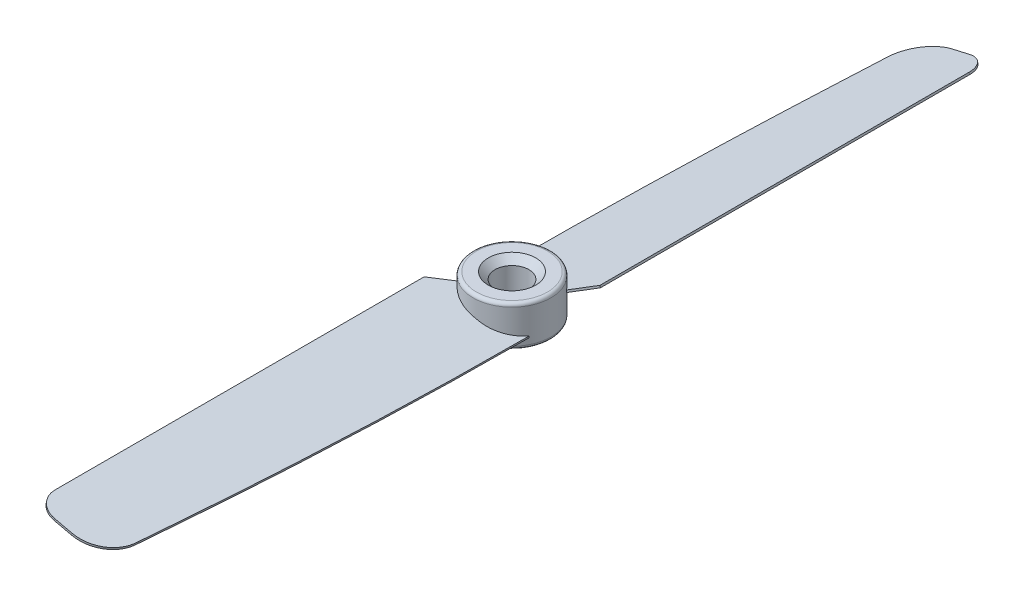
ISO-10303-21;
HEADER;
FILE_DESCRIPTION(('STEP AP214'),'2;1');
FILE_NAME('part.step','',(''),(''),'','','');
FILE_SCHEMA(('AUTOMOTIVE_DESIGN { 1 0 10303 214 1 1 1 1 }'));
ENDSEC;
DATA;
#1=APPLICATION_CONTEXT('core data for automotive mechanical design processes');
#2=APPLICATION_PROTOCOL_DEFINITION('international standard','automotive_design',2000,#1);
#3=PRODUCT_CONTEXT('',#1,'mechanical');
#4=PRODUCT('Part','Part','',(#3));
#5=PRODUCT_RELATED_PRODUCT_CATEGORY('part','',(#4));
#6=PRODUCT_DEFINITION_FORMATION('','',#4);
#7=PRODUCT_DEFINITION_CONTEXT('part definition',#1,'design');
#8=PRODUCT_DEFINITION('design','',#6,#7);
#9=PRODUCT_DEFINITION_SHAPE('','',#8);
#10=(LENGTH_UNIT() NAMED_UNIT(*) SI_UNIT(.MILLI.,.METRE.));
#11=(NAMED_UNIT(*) PLANE_ANGLE_UNIT() SI_UNIT($,.RADIAN.));
#12=(NAMED_UNIT(*) SI_UNIT($,.STERADIAN.) SOLID_ANGLE_UNIT());
#13=UNCERTAINTY_MEASURE_WITH_UNIT(LENGTH_MEASURE(1.E-05),#10,'distance_accuracy_value','');
#14=(GEOMETRIC_REPRESENTATION_CONTEXT(3) GLOBAL_UNCERTAINTY_ASSIGNED_CONTEXT((#13)) GLOBAL_UNIT_ASSIGNED_CONTEXT((#10,
#11,#12)) REPRESENTATION_CONTEXT('',''));
#15=CARTESIAN_POINT('',(0.,0.,0.));
#16=DIRECTION('',(0.,0.,1.));
#17=DIRECTION('',(1.,0.,0.));
#18=AXIS2_PLACEMENT_3D('',#15,#16,#17);
#19=CARTESIAN_POINT('',(0.,3.,0.));
#20=DIRECTION('',(0.,-1.,0.));
#21=DIRECTION('',(0.,0.,-1.));
#22=AXIS2_PLACEMENT_3D('',#19,#20,#21);
#23=CYLINDRICAL_SURFACE('',#22,5.75);
#24=CARTESIAN_POINT('',(0.,2.5,0.));
#25=DIRECTION('',(0.,1.,0.));
#26=DIRECTION('',(0.,0.,1.));
#27=AXIS2_PLACEMENT_3D('',#24,#25,#26);
#28=CIRCLE('',#27,5.75);
#29=CARTESIAN_POINT('',(0.,2.5,5.75));
#30=VERTEX_POINT('',#29);
#31=EDGE_CURVE('E665',#30,#30,#28,.F.);
#32=ORIENTED_EDGE('',*,*,#31,.T.);
#33=EDGE_LOOP('',(#32));
#34=FACE_BOUND('',#33,.T.);
#35=CARTESIAN_POINT('',(0.,-2.5,0.));
#36=DIRECTION('',(0.,1.,0.));
#37=DIRECTION('',(0.,0.,1.));
#38=AXIS2_PLACEMENT_3D('',#35,#36,#37);
#39=CIRCLE('',#38,5.75);
#40=CARTESIAN_POINT('',(0.,-2.5,5.75));
#41=VERTEX_POINT('',#40);
#42=EDGE_CURVE('E676',#41,#41,#39,.T.);
#43=ORIENTED_EDGE('',*,*,#42,.T.);
#44=EDGE_LOOP('',(#43));
#45=FACE_BOUND('',#44,.T.);
#46=CARTESIAN_POINT('',(-0.3546221575821,0.0720746401149887,-5.73905420129053));
#47=CARTESIAN_POINT('',(-0.348852411201838,0.0220916056183077,-5.73941071685677));
#48=CARTESIAN_POINT('',(-0.343082658076187,-0.0278914873125292,-5.7397585033949));
#49=CARTESIAN_POINT('',(-0.331543138334108,-0.127857790042515,-5.74043661841496));
#50=CARTESIAN_POINT('',(-0.325773371717681,-0.177840999841664,-5.74076694689689));
#51=CARTESIAN_POINT('',(-0.320003598355864,-0.227824268074969,-5.74108854635071));
#52=B_SPLINE_CURVE_WITH_KNOTS('',3,(#46,#47,#48,#49,#50,#51),.UNSPECIFIED.,.F.,.F.,(4,2,4),(0.,
0.15094861797929,0.301897235958581),.UNSPECIFIED.);
#53=CARTESIAN_POINT('',(-0.354622157582998,0.0720746401147804,-5.73905420129059));
#54=VERTEX_POINT('',#53);
#55=CARTESIAN_POINT('',(-0.320003598354752,-0.227824268074841,-5.74108854635065));
#56=VERTEX_POINT('',#55);
#57=EDGE_CURVE('E63',#54,#56,#52,.T.);
#58=ORIENTED_EDGE('',*,*,#57,.T.);
#59=CARTESIAN_POINT('',(0.,-0.153945616169008,0.));
#60=DIRECTION('',(0.224951054343865,-0.974370064785235,0.));
#61=DIRECTION('',(-0.974370064785235,-0.224951054343865,0.));
#62=AXIS2_PLACEMENT_3D('',#59,#60,#61);
#63=ELLIPSE('',#62,5.901248619812,5.75);
#64=CARTESIAN_POINT('',(4.62916827045642,0.914782088847119,-3.41076254286333));
#65=VERTEX_POINT('',#64);
#66=EDGE_CURVE('E67',#56,#65,#63,.T.);
#67=ORIENTED_EDGE('',*,*,#66,.T.);
#68=CARTESIAN_POINT('',(0.,5.80366979791248,0.));
#69=DIRECTION('',(0.688983680194812,0.15906441596161,0.707106781186551));
#70=DIRECTION('',(0.111006093354591,-0.987268206504591,0.113926009599915));
#71=AXIS2_PLACEMENT_3D('',#68,#69,#70);
#72=ELLIPSE('',#71,36.1488769517612,5.75);
#73=CARTESIAN_POINT('',(4.59996292440263,1.2159307357705,-3.45004943357646));
#74=VERTEX_POINT('',#73);
#75=EDGE_CURVE('E207',#65,#74,#72,.T.);
#76=ORIENTED_EDGE('',*,*,#75,.T.);
#77=CARTESIAN_POINT('',(0.,0.153945616169009,0.));
#78=DIRECTION('',(0.224951054343865,-0.974370064785235,0.));
#79=DIRECTION('',(-0.974370064785235,-0.224951054343865,0.));
#80=AXIS2_PLACEMENT_3D('',#77,#78,#79);
#81=ELLIPSE('',#80,5.901248619812,5.75);
#82=EDGE_CURVE('E649',#54,#74,#81,.T.);
#83=ORIENTED_EDGE('',*,*,#82,.F.);
#84=EDGE_LOOP('',(#58,#67,#76,#83));
#85=FACE_BOUND('',#84,.T.);
#86=CARTESIAN_POINT('',(0.3546221575821,0.0720746401149888,5.73905420129053));
#87=CARTESIAN_POINT('',(0.348852411201838,0.0220916056183078,5.73941071685677));
#88=CARTESIAN_POINT('',(0.343082658076187,-0.0278914873125292,5.7397585033949));
#89=CARTESIAN_POINT('',(0.331543138334108,-0.127857790042515,5.74043661841496));
#90=CARTESIAN_POINT('',(0.325773371717681,-0.177840999841664,5.74076694689689));
#91=CARTESIAN_POINT('',(0.320003598355864,-0.227824268074969,5.74108854635071));
#92=B_SPLINE_CURVE_WITH_KNOTS('',3,(#86,#87,#88,#89,#90,#91),.UNSPECIFIED.,.F.,.F.,(4,2,4),(0.,
0.15094861797929,0.301897235958581),.UNSPECIFIED.);
#93=CARTESIAN_POINT('',(0.354622157582998,0.0720746401147804,5.73905420129059));
#94=VERTEX_POINT('',#93);
#95=CARTESIAN_POINT('',(0.320003598354752,-0.227824268074841,5.74108854635065));
#96=VERTEX_POINT('',#95);
#97=EDGE_CURVE('E222',#94,#96,#92,.T.);
#98=ORIENTED_EDGE('',*,*,#97,.T.);
#99=CARTESIAN_POINT('',(0.,-0.153945616169008,0.));
#100=DIRECTION('',(-0.224951054343865,-0.974370064785235,0.));
#101=DIRECTION('',(0.974370064785235,-0.224951054343865,0.));
#102=AXIS2_PLACEMENT_3D('',#99,#100,#101);
#103=ELLIPSE('',#102,5.901248619812,5.75);
#104=CARTESIAN_POINT('',(-4.62916827045642,0.914782088847119,3.41076254286333));
#105=VERTEX_POINT('',#104);
#106=EDGE_CURVE('E230',#96,#105,#103,.T.);
#107=ORIENTED_EDGE('',*,*,#106,.T.);
#108=CARTESIAN_POINT('',(0.,5.80366979791248,0.));
#109=DIRECTION('',(-0.688983680194812,0.15906441596161,-0.707106781186551));
#110=DIRECTION('',(-0.111006093354591,-0.987268206504591,-0.113926009599915));
#111=AXIS2_PLACEMENT_3D('',#108,#109,#110);
#112=ELLIPSE('',#111,36.1488769517612,5.75);
#113=CARTESIAN_POINT('',(-4.59996292440263,1.2159307357705,3.45004943357646));
#114=VERTEX_POINT('',#113);
#115=EDGE_CURVE('E231',#105,#114,#112,.T.);
#116=ORIENTED_EDGE('',*,*,#115,.T.);
#117=CARTESIAN_POINT('',(0.,0.153945616169009,0.));
#118=DIRECTION('',(-0.224951054343865,-0.974370064785235,0.));
#119=DIRECTION('',(0.974370064785235,-0.224951054343865,0.));
#120=AXIS2_PLACEMENT_3D('',#117,#118,#119);
#121=ELLIPSE('',#120,5.901248619812,5.75);
#122=EDGE_CURVE('E303',#94,#114,#121,.T.);
#123=ORIENTED_EDGE('',*,*,#122,.F.);
#124=EDGE_LOOP('',(#98,#107,#116,#123));
#125=FACE_BOUND('',#124,.T.);
#126=ADVANCED_FACE('F47',(#34,#45,#85,#125),#23,.T.);
#127=CARTESIAN_POINT('',(0.,3.,0.));
#128=DIRECTION('',(0.,1.,0.));
#129=DIRECTION('',(0.,0.,1.));
#130=AXIS2_PLACEMENT_3D('',#127,#128,#129);
#131=PLANE('',#130);
#132=CARTESIAN_POINT('',(0.,3.,0.));
#133=DIRECTION('',(0.,1.,0.));
#134=DIRECTION('',(0.,0.,1.));
#135=AXIS2_PLACEMENT_3D('',#132,#133,#134);
#136=CIRCLE('',#135,3.5);
#137=CARTESIAN_POINT('',(0.,3.,3.5));
#138=VERTEX_POINT('',#137);
#139=EDGE_CURVE('E11',#138,#138,#136,.F.);
#140=ORIENTED_EDGE('',*,*,#139,.T.);
#141=EDGE_LOOP('',(#140));
#142=FACE_BOUND('',#141,.T.);
#143=CARTESIAN_POINT('',(0.,3.,0.));
#144=DIRECTION('',(0.,1.,0.));
#145=DIRECTION('',(0.,0.,1.));
#146=AXIS2_PLACEMENT_3D('',#143,#144,#145);
#147=CIRCLE('',#146,5.25);
#148=CARTESIAN_POINT('',(0.,3.,5.25));
#149=VERTEX_POINT('',#148);
#150=EDGE_CURVE('E678',#149,#149,#147,.T.);
#151=ORIENTED_EDGE('',*,*,#150,.T.);
#152=EDGE_LOOP('',(#151));
#153=FACE_BOUND('',#152,.T.);
#154=ADVANCED_FACE('F214',(#142,#153),#131,.T.);
#155=CARTESIAN_POINT('',(0.,-3.,0.));
#156=DIRECTION('',(0.,1.,0.));
#157=DIRECTION('',(0.,0.,1.));
#158=AXIS2_PLACEMENT_3D('',#155,#156,#157);
#159=PLANE('',#158);
#160=CARTESIAN_POINT('',(0.,-3.,0.));
#161=DIRECTION('',(0.,1.,0.));
#162=DIRECTION('',(0.,0.,1.));
#163=AXIS2_PLACEMENT_3D('',#160,#161,#162);
#164=CIRCLE('',#163,3.50000000000003);
#165=CARTESIAN_POINT('',(0.,-3.,3.50000000000003));
#166=VERTEX_POINT('',#165);
#167=EDGE_CURVE('E56',#166,#166,#164,.T.);
#168=ORIENTED_EDGE('',*,*,#167,.T.);
#169=EDGE_LOOP('',(#168));
#170=FACE_BOUND('',#169,.T.);
#171=CARTESIAN_POINT('',(0.,-3.,0.));
#172=DIRECTION('',(0.,1.,0.));
#173=DIRECTION('',(0.,0.,1.));
#174=AXIS2_PLACEMENT_3D('',#171,#172,#173);
#175=CIRCLE('',#174,5.25);
#176=CARTESIAN_POINT('',(0.,-3.,5.25));
#177=VERTEX_POINT('',#176);
#178=EDGE_CURVE('E661',#177,#177,#175,.F.);
#179=ORIENTED_EDGE('',*,*,#178,.T.);
#180=EDGE_LOOP('',(#179));
#181=FACE_BOUND('',#180,.T.);
#182=ADVANCED_FACE('F216',(#170,#181),#159,.F.);
#183=CARTESIAN_POINT('',(0.623814062032037,-0.297964440269032,0.));
#184=DIRECTION('',(-0.224951054343865,-0.974370064785235,0.));
#185=DIRECTION('',(0.,0.,1.));
#186=AXIS2_PLACEMENT_3D('',#183,#184,#185);
#187=ELLIPSE('',#186,5.75,5.6026278725151);
#188=DIRECTION('',(0.224951054343865,0.974370064785235,0.));
#189=VECTOR('',#188,1.);
#190=SURFACE_OF_LINEAR_EXTRUSION('',#187,#189);
#191=ORIENTED_EDGE('',*,*,#97,.F.);
#192=CARTESIAN_POINT('',(0.691299378335197,-0.00565342083346169,0.));
#193=DIRECTION('',(-0.224951054343865,-0.974370064785235,0.));
#194=DIRECTION('',(0.,0.,1.));
#195=AXIS2_PLACEMENT_3D('',#192,#193,#194);
#196=ELLIPSE('',#195,5.75,5.6026278725151);
#197=CARTESIAN_POINT('',(5.42014469558702,-1.09739338533998,2.8728385710794));
#198=VERTEX_POINT('',#197);
#199=EDGE_CURVE('E168',#198,#94,#196,.T.);
#200=ORIENTED_EDGE('',*,*,#199,.F.);
#201=DIRECTION('',(0.224951054343865,0.974370064785235,0.));
#202=VECTOR('',#201,1.);
#203=CARTESIAN_POINT('',(5.35265937928386,-1.38970440477555,2.8728385710794));
#204=LINE('',#203,#202);
#205=CARTESIAN_POINT('',(5.35265937928386,-1.38970440477555,2.8728385710794));
#206=VERTEX_POINT('',#205);
#207=EDGE_CURVE('E302',#206,#198,#204,.T.);
#208=ORIENTED_EDGE('',*,*,#207,.F.);
#209=EDGE_CURVE('E242',#206,#96,#187,.T.);
#210=ORIENTED_EDGE('',*,*,#209,.T.);
#211=EDGE_LOOP('',(#191,#200,#208,#210));
#212=FACE_BOUND('',#211,.T.);
#213=ADVANCED_FACE('F233',(#212),#190,.T.);
#214=CARTESIAN_POINT('',(5.35265937928386,-1.38970440477555,2.8728385710794));
#215=CARTESIAN_POINT('',(5.32497568570436,-1.38331312051518,33.8349371955117));
#216=CARTESIAN_POINT('',(3.28593611679365,-0.912563743607314,56.9677536577905));
#217=CARTESIAN_POINT('',(3.27588606991554,-0.910243507463838,58.532948550035));
#218=B_SPLINE_CURVE_WITH_KNOTS('',3,(#214,#215,#216,#217),.UNSPECIFIED.,.F.,.F.,(4,4),(0.,
0.918193757625194),.UNSPECIFIED.);
#219=DIRECTION('',(0.224951054343865,0.974370064785235,0.));
#220=VECTOR('',#219,1.);
#221=SURFACE_OF_LINEAR_EXTRUSION('',#218,#220);
#222=CARTESIAN_POINT('',(5.42014469558702,-1.09739338533998,2.8728385710794));
#223=CARTESIAN_POINT('',(5.39246100200752,-1.09100210107961,33.8349371955117));
#224=CARTESIAN_POINT('',(3.35342143309681,-0.620252724171744,56.9677536577905));
#225=CARTESIAN_POINT('',(3.3433713862187,-0.617932488028267,58.532948550035));
#226=B_SPLINE_CURVE_WITH_KNOTS('',3,(#222,#223,#224,#225),.UNSPECIFIED.,.F.,.F.,(4,4),(0.,
0.918193757625194),.UNSPECIFIED.);
#227=CARTESIAN_POINT('',(3.34337138621871,-0.617932488028264,58.5329485500349));
#228=VERTEX_POINT('',#227);
#229=EDGE_CURVE('E271',#198,#228,#226,.T.);
#230=ORIENTED_EDGE('',*,*,#229,.T.);
#231=DIRECTION('',(0.224951054343865,0.974370064785235,0.));
#232=VECTOR('',#231,1.);
#233=CARTESIAN_POINT('',(3.27588606991555,-0.910243507463834,58.5329485500349));
#234=LINE('',#233,#232);
#235=CARTESIAN_POINT('',(3.27588606991555,-0.910243507463834,58.5329485500349));
#236=VERTEX_POINT('',#235);
#237=EDGE_CURVE('E299',#236,#228,#234,.T.);
#238=ORIENTED_EDGE('',*,*,#237,.F.);
#239=EDGE_CURVE('E245',#206,#236,#218,.T.);
#240=ORIENTED_EDGE('',*,*,#239,.F.);
#241=ORIENTED_EDGE('',*,*,#207,.T.);
#242=EDGE_LOOP('',(#230,#238,#240,#241));
#243=FACE_BOUND('',#242,.T.);
#244=ADVANCED_FACE('F238',(#243),#221,.F.);
#245=CARTESIAN_POINT('',(-1.59585847457091,0.214487343147585,58.5));
#246=DIRECTION('',(0.224951054343865,0.974370064785235,0.));
#247=DIRECTION('',(-0.974370064785235,0.224951054343865,0.));
#248=AXIS2_PLACEMENT_3D('',#245,#246,#247);
#249=CYLINDRICAL_SURFACE('',#248,5.);
#250=CARTESIAN_POINT('',(-1.52837315826775,0.506798362583155,58.5));
#251=DIRECTION('',(-0.224951054343865,-0.974370064785235,0.));
#252=DIRECTION('',(0.974370064785235,-0.224951054343865,0.));
#253=AXIS2_PLACEMENT_3D('',#250,#251,#252);
#254=CIRCLE('',#253,5.);
#255=CARTESIAN_POINT('',(-1.52837315826775,0.50679836258315,63.5));
#256=VERTEX_POINT('',#255);
#257=EDGE_CURVE('E275',#228,#256,#254,.T.);
#258=ORIENTED_EDGE('',*,*,#257,.T.);
#259=DIRECTION('',(0.224951054343865,0.974370064785235,0.));
#260=VECTOR('',#259,1.);
#261=CARTESIAN_POINT('',(-1.59585847457091,0.21448734314758,63.5));
#262=LINE('',#261,#260);
#263=CARTESIAN_POINT('',(-1.59585847457091,0.21448734314758,63.5));
#264=VERTEX_POINT('',#263);
#265=EDGE_CURVE('E297',#264,#256,#262,.T.);
#266=ORIENTED_EDGE('',*,*,#265,.F.);
#267=CARTESIAN_POINT('',(-1.59585847457091,0.214487343147585,58.5));
#268=DIRECTION('',(-0.224951054343865,-0.974370064785235,0.));
#269=DIRECTION('',(0.974370064785235,-0.224951054343865,0.));
#270=AXIS2_PLACEMENT_3D('',#267,#268,#269);
#271=CIRCLE('',#270,5.);
#272=EDGE_CURVE('E252',#236,#264,#271,.T.);
#273=ORIENTED_EDGE('',*,*,#272,.F.);
#274=ORIENTED_EDGE('',*,*,#237,.T.);
#275=EDGE_LOOP('',(#258,#266,#273,#274));
#276=FACE_BOUND('',#275,.T.);
#277=ADVANCED_FACE('F333',(#276),#249,.T.);
#278=CARTESIAN_POINT('',(-0.033742658151579,-0.146155509717782,63.5));
#279=DIRECTION('',(0.,0.,1.));
#280=DIRECTION('',(1.,0.,0.));
#281=AXIS2_PLACEMENT_3D('',#278,#279,#280);
#282=PLANE('',#281);
#283=DIRECTION('',(0.974370064785235,-0.224951054343865,0.));
#284=VECTOR('',#283,1.);
#285=CARTESIAN_POINT('',(0.0337426581515806,0.146155509717789,63.5));
#286=LINE('',#285,#284);
#287=CARTESIAN_POINT('',(-4.11710145840395,1.10445338255115,63.5));
#288=VERTEX_POINT('',#287);
#289=EDGE_CURVE('E281',#288,#256,#286,.T.);
#290=ORIENTED_EDGE('',*,*,#289,.F.);
#291=DIRECTION('',(0.224951054343865,0.974370064785235,0.));
#292=VECTOR('',#291,1.);
#293=CARTESIAN_POINT('',(-4.18458677470711,0.812142363115578,63.5));
#294=LINE('',#293,#292);
#295=CARTESIAN_POINT('',(-4.18458677470711,0.812142363115578,63.5));
#296=VERTEX_POINT('',#295);
#297=EDGE_CURVE('E295',#296,#288,#294,.T.);
#298=ORIENTED_EDGE('',*,*,#297,.F.);
#299=DIRECTION('',(0.974370064785235,-0.224951054343865,0.));
#300=VECTOR('',#299,1.);
#301=CARTESIAN_POINT('',(-0.033742658151579,-0.146155509717782,63.5));
#302=LINE('',#301,#300);
#303=EDGE_CURVE('E257',#296,#264,#302,.T.);
#304=ORIENTED_EDGE('',*,*,#303,.T.);
#305=ORIENTED_EDGE('',*,*,#265,.T.);
#306=EDGE_LOOP('',(#290,#298,#304,#305));
#307=FACE_BOUND('',#306,.T.);
#308=ADVANCED_FACE('F329',(#307),#282,.T.);
#309=CARTESIAN_POINT('',(-4.18458677470712,0.812142363115587,60.5));
#310=DIRECTION('',(0.224951054343865,0.974370064785235,0.));
#311=DIRECTION('',(-0.974370064785235,0.224951054343865,0.));
#312=AXIS2_PLACEMENT_3D('',#309,#310,#311);
#313=CYLINDRICAL_SURFACE('',#312,3.);
#314=CARTESIAN_POINT('',(-4.11710145840396,1.10445338255116,60.5));
#315=DIRECTION('',(-0.224951054343865,-0.974370064785235,0.));
#316=DIRECTION('',(0.974370064785235,-0.224951054343865,0.));
#317=AXIS2_PLACEMENT_3D('',#314,#315,#316);
#318=CIRCLE('',#317,3.);
#319=CARTESIAN_POINT('',(-7.04021165275967,1.77930654558275,60.5));
#320=VERTEX_POINT('',#319);
#321=EDGE_CURVE('E284',#320,#288,#318,.F.);
#322=ORIENTED_EDGE('',*,*,#321,.F.);
#323=DIRECTION('',(0.224951054343865,0.974370064785235,0.));
#324=VECTOR('',#323,1.);
#325=CARTESIAN_POINT('',(-7.10769696906283,1.48699552614718,60.5));
#326=LINE('',#325,#324);
#327=CARTESIAN_POINT('',(-7.10769696906283,1.48699552614718,60.5));
#328=VERTEX_POINT('',#327);
#329=EDGE_CURVE('E293',#328,#320,#326,.T.);
#330=ORIENTED_EDGE('',*,*,#329,.F.);
#331=CARTESIAN_POINT('',(-4.18458677470712,0.812142363115587,60.5));
#332=DIRECTION('',(-0.224951054343865,-0.974370064785235,0.));
#333=DIRECTION('',(0.974370064785235,-0.224951054343865,0.));
#334=AXIS2_PLACEMENT_3D('',#331,#332,#333);
#335=CIRCLE('',#334,3.);
#336=EDGE_CURVE('E260',#328,#296,#335,.F.);
#337=ORIENTED_EDGE('',*,*,#336,.T.);
#338=ORIENTED_EDGE('',*,*,#297,.T.);
#339=EDGE_LOOP('',(#322,#330,#337,#338));
#340=FACE_BOUND('',#339,.T.);
#341=ADVANCED_FACE('F327',(#340),#313,.T.);
#342=CARTESIAN_POINT('',(-7.10769696906284,1.48699552614718,0.));
#343=DIRECTION('',(-0.974370064785235,0.224951054343865,0.));
#344=DIRECTION('',(-0.224951054343865,-0.974370064785235,0.));
#345=AXIS2_PLACEMENT_3D('',#342,#343,#344);
#346=PLANE('',#345);
#347=DIRECTION('',(0.,0.,1.));
#348=VECTOR('',#347,1.);
#349=CARTESIAN_POINT('',(-7.04021165275968,1.77930654558275,0.));
#350=LINE('',#349,#348);
#351=CARTESIAN_POINT('',(-7.04021165275968,1.77930654558275,5.95448672752687));
#352=VERTEX_POINT('',#351);
#353=EDGE_CURVE('E287',#352,#320,#350,.T.);
#354=ORIENTED_EDGE('',*,*,#353,.F.);
#355=DIRECTION('',(0.224951054343865,0.974370064785235,0.));
#356=VECTOR('',#355,1.);
#357=CARTESIAN_POINT('',(-7.10769696906284,1.48699552614718,5.95448672752687));
#358=LINE('',#357,#356);
#359=CARTESIAN_POINT('',(-7.10769696906284,1.48699552614718,5.95448672752687));
#360=VERTEX_POINT('',#359);
#361=EDGE_CURVE('E268',#360,#352,#358,.T.);
#362=ORIENTED_EDGE('',*,*,#361,.F.);
#363=DIRECTION('',(0.,0.,1.));
#364=VECTOR('',#363,1.);
#365=CARTESIAN_POINT('',(-7.10769696906284,1.48699552614718,0.));
#366=LINE('',#365,#364);
#367=EDGE_CURVE('E263',#360,#328,#366,.T.);
#368=ORIENTED_EDGE('',*,*,#367,.T.);
#369=ORIENTED_EDGE('',*,*,#329,.T.);
#370=EDGE_LOOP('',(#354,#362,#368,#369));
#371=FACE_BOUND('',#370,.T.);
#372=ADVANCED_FACE('F322',(#371),#346,.T.);
#373=CARTESIAN_POINT('',(-0.669783004375581,0.000685974497827591,-0.65277082005203));
#374=DIRECTION('',(-0.688983680194812,0.15906441596161,-0.707106781186551));
#375=DIRECTION('',(-0.716225617849128,0.,0.697868801664493));
#376=AXIS2_PLACEMENT_3D('',#373,#374,#375);
#377=PLANE('',#376);
#378=ORIENTED_EDGE('',*,*,#115,.F.);
#379=DIRECTION('',(-0.688983680194819,0.159064415961612,0.707106781186544));
#380=VECTOR('',#379,1.);
#381=CARTESIAN_POINT('',(-0.669783004375581,0.000685974497827591,-0.65277082005203));
#382=LINE('',#381,#380);
#383=EDGE_CURVE('E266',#105,#360,#382,.T.);
#384=ORIENTED_EDGE('',*,*,#383,.T.);
#385=ORIENTED_EDGE('',*,*,#361,.T.);
#386=DIRECTION('',(-0.688983680194819,0.159064415961612,0.707106781186544));
#387=VECTOR('',#386,1.);
#388=CARTESIAN_POINT('',(-0.602297688072421,0.292996993933398,-0.65277082005203));
#389=LINE('',#388,#387);
#390=EDGE_CURVE('E246',#114,#352,#389,.T.);
#391=ORIENTED_EDGE('',*,*,#390,.F.);
#392=EDGE_LOOP('',(#378,#384,#385,#391));
#393=FACE_BOUND('',#392,.T.);
#394=ADVANCED_FACE('F313',(#393),#377,.T.);
#395=CARTESIAN_POINT('',(-0.0337426581515796,-0.146155509717785,0.));
#396=DIRECTION('',(-0.224951054343865,-0.974370064785235,0.));
#397=DIRECTION('',(0.974370064785235,-0.224951054343865,0.));
#398=AXIS2_PLACEMENT_3D('',#395,#396,#397);
#399=PLANE('',#398);
#400=ORIENTED_EDGE('',*,*,#106,.F.);
#401=ORIENTED_EDGE('',*,*,#209,.F.);
#402=ORIENTED_EDGE('',*,*,#239,.T.);
#403=ORIENTED_EDGE('',*,*,#272,.T.);
#404=ORIENTED_EDGE('',*,*,#303,.F.);
#405=ORIENTED_EDGE('',*,*,#336,.F.);
#406=ORIENTED_EDGE('',*,*,#367,.F.);
#407=ORIENTED_EDGE('',*,*,#383,.F.);
#408=EDGE_LOOP('',(#400,#401,#402,#403,#404,#405,#406,#407));
#409=FACE_BOUND('',#408,.T.);
#410=ADVANCED_FACE('F197',(#409),#399,.T.);
#411=CARTESIAN_POINT('',(0.03374265815158,0.146155509717786,0.));
#412=DIRECTION('',(-0.224951054343865,-0.974370064785235,0.));
#413=DIRECTION('',(0.974370064785235,-0.224951054343865,0.));
#414=AXIS2_PLACEMENT_3D('',#411,#412,#413);
#415=PLANE('',#414);
#416=ORIENTED_EDGE('',*,*,#199,.T.);
#417=ORIENTED_EDGE('',*,*,#122,.T.);
#418=ORIENTED_EDGE('',*,*,#390,.T.);
#419=ORIENTED_EDGE('',*,*,#353,.T.);
#420=ORIENTED_EDGE('',*,*,#321,.T.);
#421=ORIENTED_EDGE('',*,*,#289,.T.);
#422=ORIENTED_EDGE('',*,*,#257,.F.);
#423=ORIENTED_EDGE('',*,*,#229,.F.);
#424=EDGE_LOOP('',(#416,#417,#418,#419,#420,#421,#422,#423));
#425=FACE_BOUND('',#424,.T.);
#426=ADVANCED_FACE('F195',(#425),#415,.F.);
#427=CARTESIAN_POINT('',(-0.623814062032037,-0.297964440269032,0.));
#428=DIRECTION('',(0.224951054343865,-0.974370064785235,0.));
#429=DIRECTION('',(0.,0.,-1.));
#430=AXIS2_PLACEMENT_3D('',#427,#428,#429);
#431=ELLIPSE('',#430,5.75,5.6026278725151);
#432=DIRECTION('',(-0.224951054343865,0.974370064785235,0.));
#433=VECTOR('',#432,1.);
#434=SURFACE_OF_LINEAR_EXTRUSION('',#431,#433);
#435=ORIENTED_EDGE('',*,*,#57,.F.);
#436=CARTESIAN_POINT('',(-0.691299378335197,-0.00565342083346169,0.));
#437=DIRECTION('',(0.224951054343865,-0.974370064785235,0.));
#438=DIRECTION('',(0.,0.,-1.));
#439=AXIS2_PLACEMENT_3D('',#436,#437,#438);
#440=ELLIPSE('',#439,5.75,5.6026278725151);
#441=CARTESIAN_POINT('',(-5.42014469558702,-1.09739338533998,-2.8728385710794));
#442=VERTEX_POINT('',#441);
#443=EDGE_CURVE('E165',#442,#54,#440,.T.);
#444=ORIENTED_EDGE('',*,*,#443,.F.);
#445=DIRECTION('',(-0.224951054343865,0.974370064785235,0.));
#446=VECTOR('',#445,1.);
#447=CARTESIAN_POINT('',(-5.35265937928386,-1.38970440477555,-2.8728385710794));
#448=LINE('',#447,#446);
#449=CARTESIAN_POINT('',(-5.35265937928386,-1.38970440477555,-2.8728385710794));
#450=VERTEX_POINT('',#449);
#451=EDGE_CURVE('E159',#450,#442,#448,.T.);
#452=ORIENTED_EDGE('',*,*,#451,.F.);
#453=EDGE_CURVE('E163',#450,#56,#431,.T.);
#454=ORIENTED_EDGE('',*,*,#453,.T.);
#455=EDGE_LOOP('',(#435,#444,#452,#454));
#456=FACE_BOUND('',#455,.T.);
#457=ADVANCED_FACE('F161',(#456),#434,.T.);
#458=CARTESIAN_POINT('',(-5.35265937928386,-1.38970440477555,-2.8728385710794));
#459=CARTESIAN_POINT('',(-5.32497568570436,-1.38331312051518,-33.8349371955117));
#460=CARTESIAN_POINT('',(-3.28593611679365,-0.912563743607314,-56.9677536577905));
#461=CARTESIAN_POINT('',(-3.27588606991554,-0.910243507463838,-58.532948550035));
#462=B_SPLINE_CURVE_WITH_KNOTS('',3,(#458,#459,#460,#461),.UNSPECIFIED.,.F.,.F.,(4,4),(0.,
0.918193757625194),.UNSPECIFIED.);
#463=DIRECTION('',(-0.224951054343865,0.974370064785235,0.));
#464=VECTOR('',#463,1.);
#465=SURFACE_OF_LINEAR_EXTRUSION('',#462,#464);
#466=CARTESIAN_POINT('',(-5.42014469558702,-1.09739338533998,-2.8728385710794));
#467=CARTESIAN_POINT('',(-5.39246100200752,-1.09100210107961,-33.8349371955117));
#468=CARTESIAN_POINT('',(-3.35342143309681,-0.620252724171744,-56.9677536577905));
#469=CARTESIAN_POINT('',(-3.3433713862187,-0.617932488028267,-58.532948550035));
#470=B_SPLINE_CURVE_WITH_KNOTS('',3,(#466,#467,#468,#469),.UNSPECIFIED.,.F.,.F.,(4,4),(0.,
0.918193757625194),.UNSPECIFIED.);
#471=CARTESIAN_POINT('',(-3.34337138621871,-0.617932488028264,-58.5329485500349));
#472=VERTEX_POINT('',#471);
#473=EDGE_CURVE('E611',#442,#472,#470,.T.);
#474=ORIENTED_EDGE('',*,*,#473,.T.);
#475=DIRECTION('',(-0.224951054343865,0.974370064785235,0.));
#476=VECTOR('',#475,1.);
#477=CARTESIAN_POINT('',(-3.27588606991555,-0.910243507463834,-58.5329485500349));
#478=LINE('',#477,#476);
#479=CARTESIAN_POINT('',(-3.27588606991555,-0.910243507463834,-58.5329485500349));
#480=VERTEX_POINT('',#479);
#481=EDGE_CURVE('E169',#480,#472,#478,.T.);
#482=ORIENTED_EDGE('',*,*,#481,.F.);
#483=EDGE_CURVE('E172',#450,#480,#462,.T.);
#484=ORIENTED_EDGE('',*,*,#483,.F.);
#485=ORIENTED_EDGE('',*,*,#451,.T.);
#486=EDGE_LOOP('',(#474,#482,#484,#485));
#487=FACE_BOUND('',#486,.T.);
#488=ADVANCED_FACE('F173',(#487),#465,.F.);
#489=CARTESIAN_POINT('',(1.59585847457091,0.214487343147585,-58.5));
#490=DIRECTION('',(-0.224951054343865,0.974370064785235,0.));
#491=DIRECTION('',(-0.974370064785235,-0.224951054343865,0.));
#492=AXIS2_PLACEMENT_3D('',#489,#490,#491);
#493=CYLINDRICAL_SURFACE('',#492,5.);
#494=CARTESIAN_POINT('',(1.52837315826775,0.506798362583155,-58.5));
#495=DIRECTION('',(0.224951054343865,-0.974370064785235,0.));
#496=DIRECTION('',(-0.974370064785235,-0.224951054343865,0.));
#497=AXIS2_PLACEMENT_3D('',#494,#495,#496);
#498=CIRCLE('',#497,5.);
#499=CARTESIAN_POINT('',(1.52837315826775,0.50679836258315,-63.5));
#500=VERTEX_POINT('',#499);
#501=EDGE_CURVE('E606',#472,#500,#498,.T.);
#502=ORIENTED_EDGE('',*,*,#501,.T.);
#503=DIRECTION('',(-0.224951054343865,0.974370064785235,0.));
#504=VECTOR('',#503,1.);
#505=CARTESIAN_POINT('',(1.59585847457091,0.21448734314758,-63.5));
#506=LINE('',#505,#504);
#507=CARTESIAN_POINT('',(1.59585847457091,0.21448734314758,-63.5));
#508=VERTEX_POINT('',#507);
#509=EDGE_CURVE('E608',#508,#500,#506,.T.);
#510=ORIENTED_EDGE('',*,*,#509,.F.);
#511=CARTESIAN_POINT('',(1.59585847457091,0.214487343147585,-58.5));
#512=DIRECTION('',(0.224951054343865,-0.974370064785235,0.));
#513=DIRECTION('',(-0.974370064785235,-0.224951054343865,0.));
#514=AXIS2_PLACEMENT_3D('',#511,#512,#513);
#515=CIRCLE('',#514,5.);
#516=EDGE_CURVE('E177',#480,#508,#515,.T.);
#517=ORIENTED_EDGE('',*,*,#516,.F.);
#518=ORIENTED_EDGE('',*,*,#481,.T.);
#519=EDGE_LOOP('',(#502,#510,#517,#518));
#520=FACE_BOUND('',#519,.T.);
#521=ADVANCED_FACE('F523',(#520),#493,.T.);
#522=CARTESIAN_POINT('',(0.033742658151579,-0.146155509717782,-63.5));
#523=DIRECTION('',(0.,0.,-1.));
#524=DIRECTION('',(-1.,0.,0.));
#525=AXIS2_PLACEMENT_3D('',#522,#523,#524);
#526=PLANE('',#525);
#527=DIRECTION('',(-0.974370064785235,-0.224951054343865,0.));
#528=VECTOR('',#527,1.);
#529=CARTESIAN_POINT('',(-0.0337426581515806,0.146155509717789,-63.5));
#530=LINE('',#529,#528);
#531=CARTESIAN_POINT('',(4.11710145840395,1.10445338255115,-63.5));
#532=VERTEX_POINT('',#531);
#533=EDGE_CURVE('E610',#532,#500,#530,.T.);
#534=ORIENTED_EDGE('',*,*,#533,.F.);
#535=DIRECTION('',(-0.224951054343865,0.974370064785235,0.));
#536=VECTOR('',#535,1.);
#537=CARTESIAN_POINT('',(4.18458677470711,0.812142363115578,-63.5));
#538=LINE('',#537,#536);
#539=CARTESIAN_POINT('',(4.18458677470711,0.812142363115578,-63.5));
#540=VERTEX_POINT('',#539);
#541=EDGE_CURVE('E629',#540,#532,#538,.T.);
#542=ORIENTED_EDGE('',*,*,#541,.F.);
#543=DIRECTION('',(-0.974370064785235,-0.224951054343865,0.));
#544=VECTOR('',#543,1.);
#545=CARTESIAN_POINT('',(0.033742658151579,-0.146155509717782,-63.5));
#546=LINE('',#545,#544);
#547=EDGE_CURVE('E632',#540,#508,#546,.T.);
#548=ORIENTED_EDGE('',*,*,#547,.T.);
#549=ORIENTED_EDGE('',*,*,#509,.T.);
#550=EDGE_LOOP('',(#534,#542,#548,#549));
#551=FACE_BOUND('',#550,.T.);
#552=ADVANCED_FACE('F513',(#551),#526,.T.);
#553=CARTESIAN_POINT('',(4.18458677470712,0.812142363115587,-60.5));
#554=DIRECTION('',(-0.224951054343865,0.974370064785235,0.));
#555=DIRECTION('',(-0.974370064785235,-0.224951054343865,0.));
#556=AXIS2_PLACEMENT_3D('',#553,#554,#555);
#557=CYLINDRICAL_SURFACE('',#556,3.);
#558=CARTESIAN_POINT('',(4.11710145840396,1.10445338255116,-60.5));
#559=DIRECTION('',(0.224951054343865,-0.974370064785235,0.));
#560=DIRECTION('',(-0.974370064785235,-0.224951054343865,0.));
#561=AXIS2_PLACEMENT_3D('',#558,#559,#560);
#562=CIRCLE('',#561,3.);
#563=CARTESIAN_POINT('',(7.04021165275967,1.77930654558275,-60.5));
#564=VERTEX_POINT('',#563);
#565=EDGE_CURVE('E617',#564,#532,#562,.F.);
#566=ORIENTED_EDGE('',*,*,#565,.F.);
#567=DIRECTION('',(-0.224951054343865,0.974370064785235,0.));
#568=VECTOR('',#567,1.);
#569=CARTESIAN_POINT('',(7.10769696906283,1.48699552614718,-60.5));
#570=LINE('',#569,#568);
#571=CARTESIAN_POINT('',(7.10769696906283,1.48699552614718,-60.5));
#572=VERTEX_POINT('',#571);
#573=EDGE_CURVE('E626',#572,#564,#570,.T.);
#574=ORIENTED_EDGE('',*,*,#573,.F.);
#575=CARTESIAN_POINT('',(4.18458677470712,0.812142363115587,-60.5));
#576=DIRECTION('',(0.224951054343865,-0.974370064785235,0.));
#577=DIRECTION('',(-0.974370064785235,-0.224951054343865,0.));
#578=AXIS2_PLACEMENT_3D('',#575,#576,#577);
#579=CIRCLE('',#578,3.);
#580=EDGE_CURVE('E635',#572,#540,#579,.F.);
#581=ORIENTED_EDGE('',*,*,#580,.T.);
#582=ORIENTED_EDGE('',*,*,#541,.T.);
#583=EDGE_LOOP('',(#566,#574,#581,#582));
#584=FACE_BOUND('',#583,.T.);
#585=ADVANCED_FACE('F503',(#584),#557,.T.);
#586=CARTESIAN_POINT('',(7.10769696906284,1.48699552614718,0.));
#587=DIRECTION('',(0.974370064785235,0.224951054343865,0.));
#588=DIRECTION('',(-0.224951054343865,0.974370064785235,0.));
#589=AXIS2_PLACEMENT_3D('',#586,#587,#588);
#590=PLANE('',#589);
#591=DIRECTION('',(0.,0.,-1.));
#592=VECTOR('',#591,1.);
#593=CARTESIAN_POINT('',(7.04021165275968,1.77930654558275,0.));
#594=LINE('',#593,#592);
#595=CARTESIAN_POINT('',(7.04021165275968,1.77930654558275,-5.95448672752687));
#596=VERTEX_POINT('',#595);
#597=EDGE_CURVE('E183',#596,#564,#594,.T.);
#598=ORIENTED_EDGE('',*,*,#597,.F.);
#599=DIRECTION('',(-0.224951054343865,0.974370064785235,0.));
#600=VECTOR('',#599,1.);
#601=CARTESIAN_POINT('',(7.10769696906284,1.48699552614718,-5.95448672752687));
#602=LINE('',#601,#600);
#603=CARTESIAN_POINT('',(7.10769696906284,1.48699552614718,-5.95448672752687));
#604=VERTEX_POINT('',#603);
#605=EDGE_CURVE('E623',#604,#596,#602,.T.);
#606=ORIENTED_EDGE('',*,*,#605,.F.);
#607=DIRECTION('',(0.,0.,-1.));
#608=VECTOR('',#607,1.);
#609=CARTESIAN_POINT('',(7.10769696906284,1.48699552614718,0.));
#610=LINE('',#609,#608);
#611=EDGE_CURVE('E637',#604,#572,#610,.T.);
#612=ORIENTED_EDGE('',*,*,#611,.T.);
#613=ORIENTED_EDGE('',*,*,#573,.T.);
#614=EDGE_LOOP('',(#598,#606,#612,#613));
#615=FACE_BOUND('',#614,.T.);
#616=ADVANCED_FACE('F493',(#615),#590,.T.);
#617=CARTESIAN_POINT('',(0.669783004375581,0.000685974497827591,0.65277082005203));
#618=DIRECTION('',(0.688983680194812,0.15906441596161,0.707106781186551));
#619=DIRECTION('',(0.716225617849128,0.,-0.697868801664493));
#620=AXIS2_PLACEMENT_3D('',#617,#618,#619);
#621=PLANE('',#620);
#622=ORIENTED_EDGE('',*,*,#75,.F.);
#623=DIRECTION('',(0.688983680194819,0.159064415961612,-0.707106781186544));
#624=VECTOR('',#623,1.);
#625=CARTESIAN_POINT('',(0.669783004375581,0.000685974497827591,0.65277082005203));
#626=LINE('',#625,#624);
#627=EDGE_CURVE('E627',#65,#604,#626,.T.);
#628=ORIENTED_EDGE('',*,*,#627,.T.);
#629=ORIENTED_EDGE('',*,*,#605,.T.);
#630=DIRECTION('',(0.688983680194819,0.159064415961612,-0.707106781186544));
#631=VECTOR('',#630,1.);
#632=CARTESIAN_POINT('',(0.602297688072421,0.292996993933398,0.65277082005203));
#633=LINE('',#632,#631);
#634=EDGE_CURVE('E181',#74,#596,#633,.T.);
#635=ORIENTED_EDGE('',*,*,#634,.F.);
#636=EDGE_LOOP('',(#622,#628,#629,#635));
#637=FACE_BOUND('',#636,.T.);
#638=ADVANCED_FACE('F485',(#637),#621,.T.);
#639=CARTESIAN_POINT('',(0.0337426581515796,-0.146155509717785,0.));
#640=DIRECTION('',(0.224951054343865,-0.974370064785235,0.));
#641=DIRECTION('',(-0.974370064785235,-0.224951054343865,0.));
#642=AXIS2_PLACEMENT_3D('',#639,#640,#641);
#643=PLANE('',#642);
#644=ORIENTED_EDGE('',*,*,#66,.F.);
#645=ORIENTED_EDGE('',*,*,#453,.F.);
#646=ORIENTED_EDGE('',*,*,#483,.T.);
#647=ORIENTED_EDGE('',*,*,#516,.T.);
#648=ORIENTED_EDGE('',*,*,#547,.F.);
#649=ORIENTED_EDGE('',*,*,#580,.F.);
#650=ORIENTED_EDGE('',*,*,#611,.F.);
#651=ORIENTED_EDGE('',*,*,#627,.F.);
#652=EDGE_LOOP('',(#644,#645,#646,#647,#648,#649,#650,#651));
#653=FACE_BOUND('',#652,.T.);
#654=ADVANCED_FACE('F179',(#653),#643,.T.);
#655=CARTESIAN_POINT('',(-0.03374265815158,0.146155509717786,0.));
#656=DIRECTION('',(0.224951054343865,-0.974370064785235,0.));
#657=DIRECTION('',(-0.974370064785235,-0.224951054343865,0.));
#658=AXIS2_PLACEMENT_3D('',#655,#656,#657);
#659=PLANE('',#658);
#660=ORIENTED_EDGE('',*,*,#443,.T.);
#661=ORIENTED_EDGE('',*,*,#82,.T.);
#662=ORIENTED_EDGE('',*,*,#634,.T.);
#663=ORIENTED_EDGE('',*,*,#597,.T.);
#664=ORIENTED_EDGE('',*,*,#565,.T.);
#665=ORIENTED_EDGE('',*,*,#533,.T.);
#666=ORIENTED_EDGE('',*,*,#501,.F.);
#667=ORIENTED_EDGE('',*,*,#473,.F.);
#668=EDGE_LOOP('',(#660,#661,#662,#663,#664,#665,#666,#667));
#669=FACE_BOUND('',#668,.T.);
#670=ADVANCED_FACE('F420',(#669),#659,.F.);
#671=CARTESIAN_POINT('',(0.,3.,0.));
#672=DIRECTION('',(0.,-1.,0.));
#673=DIRECTION('',(0.,0.,-1.));
#674=AXIS2_PLACEMENT_3D('',#671,#672,#673);
#675=CYLINDRICAL_SURFACE('',#674,2.5);
#676=CARTESIAN_POINT('',(0.,-1.99999999999997,0.));
#677=DIRECTION('',(0.,1.,0.));
#678=DIRECTION('',(0.,0.,1.));
#679=AXIS2_PLACEMENT_3D('',#676,#677,#678);
#680=CIRCLE('',#679,2.5);
#681=CARTESIAN_POINT('',(0.,-1.99999999999997,2.5));
#682=VERTEX_POINT('',#681);
#683=EDGE_CURVE('E657',#682,#682,#680,.F.);
#684=ORIENTED_EDGE('',*,*,#683,.T.);
#685=EDGE_LOOP('',(#684));
#686=FACE_BOUND('',#685,.T.);
#687=CARTESIAN_POINT('',(0.,2.00000000000001,0.));
#688=DIRECTION('',(0.,1.,0.));
#689=DIRECTION('',(0.,0.,1.));
#690=AXIS2_PLACEMENT_3D('',#687,#688,#689);
#691=CIRCLE('',#690,2.5);
#692=CARTESIAN_POINT('',(0.,2.00000000000001,2.5));
#693=VERTEX_POINT('',#692);
#694=EDGE_CURVE('E660',#693,#693,#691,.T.);
#695=ORIENTED_EDGE('',*,*,#694,.T.);
#696=EDGE_LOOP('',(#695));
#697=FACE_BOUND('',#696,.T.);
#698=ADVANCED_FACE('F429',(#686,#697),#675,.F.);
#699=CARTESIAN_POINT('',(0.,2.5,0.));
#700=DIRECTION('',(0.,1.,0.));
#701=DIRECTION('',(0.,0.,1.));
#702=AXIS2_PLACEMENT_3D('',#699,#700,#701);
#703=TOROIDAL_SURFACE('',#702,5.25,0.5);
#704=ORIENTED_EDGE('',*,*,#31,.F.);
#705=EDGE_LOOP('',(#704));
#706=FACE_BOUND('',#705,.T.);
#707=ORIENTED_EDGE('',*,*,#150,.F.);
#708=EDGE_LOOP('',(#707));
#709=FACE_BOUND('',#708,.T.);
#710=ADVANCED_FACE('F218',(#706,#709),#703,.T.);
#711=CARTESIAN_POINT('',(0.,-2.5,0.));
#712=DIRECTION('',(0.,1.,0.));
#713=DIRECTION('',(0.,0.,1.));
#714=AXIS2_PLACEMENT_3D('',#711,#712,#713);
#715=TOROIDAL_SURFACE('',#714,5.25,0.5);
#716=ORIENTED_EDGE('',*,*,#178,.F.);
#717=EDGE_LOOP('',(#716));
#718=FACE_BOUND('',#717,.T.);
#719=ORIENTED_EDGE('',*,*,#42,.F.);
#720=EDGE_LOOP('',(#719));
#721=FACE_BOUND('',#720,.T.);
#722=ADVANCED_FACE('F428',(#718,#721),#715,.T.);
#723=CARTESIAN_POINT('',(0.,-1.99999999999997,0.));
#724=DIRECTION('',(0.,-1.,0.));
#725=DIRECTION('',(0.,0.,-1.));
#726=AXIS2_PLACEMENT_3D('',#723,#724,#725);
#727=CONICAL_SURFACE('',#726,2.5,0.785398163397451);
#728=ORIENTED_EDGE('',*,*,#167,.F.);
#729=EDGE_LOOP('',(#728));
#730=FACE_BOUND('',#729,.T.);
#731=ORIENTED_EDGE('',*,*,#683,.F.);
#732=EDGE_LOOP('',(#731));
#733=FACE_BOUND('',#732,.T.);
#734=ADVANCED_FACE('F440',(#730,#733),#727,.F.);
#735=CARTESIAN_POINT('',(0.,3.,0.));
#736=DIRECTION('',(0.,1.,0.));
#737=DIRECTION('',(0.,0.,1.));
#738=AXIS2_PLACEMENT_3D('',#735,#736,#737);
#739=CONICAL_SURFACE('',#738,3.5,0.785398163397453);
#740=ORIENTED_EDGE('',*,*,#694,.F.);
#741=EDGE_LOOP('',(#740));
#742=FACE_BOUND('',#741,.T.);
#743=ORIENTED_EDGE('',*,*,#139,.F.);
#744=EDGE_LOOP('',(#743));
#745=FACE_BOUND('',#744,.T.);
#746=ADVANCED_FACE('F50',(#742,#745),#739,.F.);
#747=CLOSED_SHELL('',(#126,#154,#182,#213,#244,#277,#308,#341,#372,#394,#410,#426,#457,#488,
#521,#552,#585,#616,#638,#654,#670,#698,#710,#722,#734,#746));
#748=MANIFOLD_SOLID_BREP('B2',#747);
#749=ADVANCED_BREP_SHAPE_REPRESENTATION('',(#18,#748),#14);
#750=SHAPE_DEFINITION_REPRESENTATION(#9,#749);
ENDSEC;
END-ISO-10303-21;
